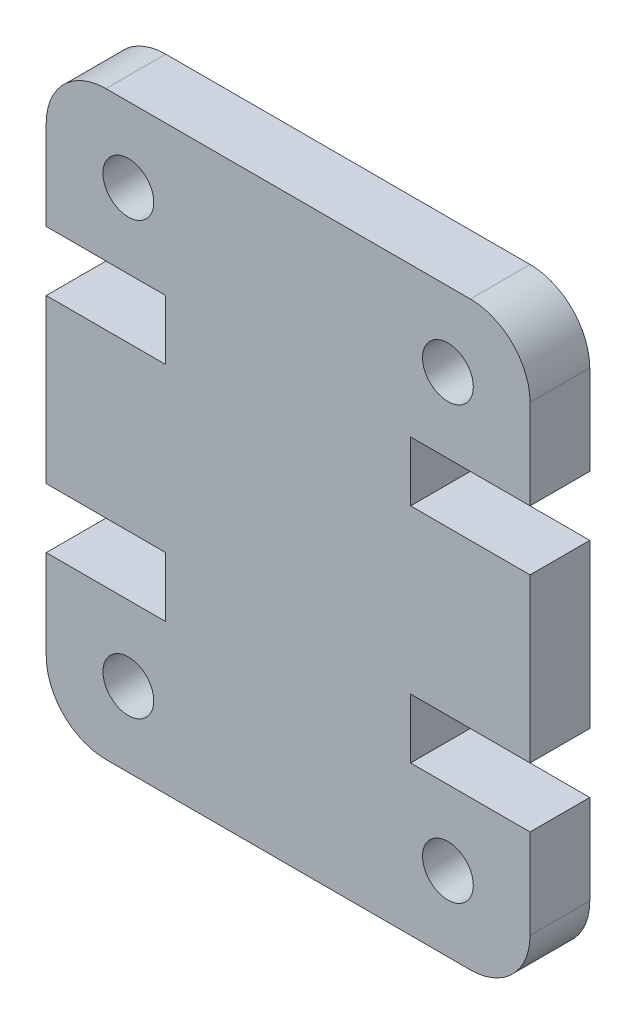
ISO-10303-21;
HEADER;
FILE_DESCRIPTION(('STEP AP214'),'2;1');
FILE_NAME('part.step','',(''),(''),'','','');
FILE_SCHEMA(('AUTOMOTIVE_DESIGN { 1 0 10303 214 1 1 1 1 }'));
ENDSEC;
DATA;
#1=APPLICATION_CONTEXT('core data for automotive mechanical design processes');
#2=APPLICATION_PROTOCOL_DEFINITION('international standard','automotive_design',2000,#1);
#3=PRODUCT_CONTEXT('',#1,'mechanical');
#4=PRODUCT('Part','Part','',(#3));
#5=PRODUCT_RELATED_PRODUCT_CATEGORY('part','',(#4));
#6=PRODUCT_DEFINITION_FORMATION('','',#4);
#7=PRODUCT_DEFINITION_CONTEXT('part definition',#1,'design');
#8=PRODUCT_DEFINITION('design','',#6,#7);
#9=PRODUCT_DEFINITION_SHAPE('','',#8);
#10=(LENGTH_UNIT() NAMED_UNIT(*) SI_UNIT(.MILLI.,.METRE.));
#11=(NAMED_UNIT(*) PLANE_ANGLE_UNIT() SI_UNIT($,.RADIAN.));
#12=(NAMED_UNIT(*) SI_UNIT($,.STERADIAN.) SOLID_ANGLE_UNIT());
#13=UNCERTAINTY_MEASURE_WITH_UNIT(LENGTH_MEASURE(1.E-05),#10,'distance_accuracy_value','');
#14=(GEOMETRIC_REPRESENTATION_CONTEXT(3) GLOBAL_UNCERTAINTY_ASSIGNED_CONTEXT((#13)) GLOBAL_UNIT_ASSIGNED_CONTEXT((#10,
#11,#12)) REPRESENTATION_CONTEXT('',''));
#15=CARTESIAN_POINT('',(0.,0.,0.));
#16=DIRECTION('',(0.,0.,1.));
#17=DIRECTION('',(1.,0.,0.));
#18=AXIS2_PLACEMENT_3D('',#15,#16,#17);
#19=CARTESIAN_POINT('',(14.1999999999999,2.00000000000013,4.));
#20=DIRECTION('',(0.,0.,-1.));
#21=DIRECTION('',(-1.,0.,0.));
#22=AXIS2_PLACEMENT_3D('',#19,#20,#21);
#23=CYLINDRICAL_SURFACE('',#22,2.00000000000013);
#24=CARTESIAN_POINT('',(14.1999999999999,2.00000000000013,2.));
#25=DIRECTION('',(0.,0.,1.));
#26=DIRECTION('',(1.,0.,0.));
#27=AXIS2_PLACEMENT_3D('',#24,#25,#26);
#28=CIRCLE('',#27,2.00000000000013);
#29=CARTESIAN_POINT('',(14.1999999999999,0.,2.));
#30=VERTEX_POINT('',#29);
#31=CARTESIAN_POINT('',(16.2,2.00000000000013,2.));
#32=VERTEX_POINT('',#31);
#33=EDGE_CURVE('E387',#30,#32,#28,.T.);
#34=ORIENTED_EDGE('',*,*,#33,.F.);
#35=DIRECTION('',(0.,0.,-1.));
#36=VECTOR('',#35,1.);
#37=CARTESIAN_POINT('',(14.1999999999999,0.,4.));
#38=LINE('',#37,#36);
#39=CARTESIAN_POINT('',(14.1999999999999,0.,0.));
#40=VERTEX_POINT('',#39);
#41=EDGE_CURVE('E56',#30,#40,#38,.T.);
#42=ORIENTED_EDGE('',*,*,#41,.T.);
#43=CARTESIAN_POINT('',(14.1999999999999,2.00000000000013,0.));
#44=DIRECTION('',(0.,0.,1.));
#45=DIRECTION('',(-1.,0.,0.));
#46=AXIS2_PLACEMENT_3D('',#43,#44,#45);
#47=CIRCLE('',#46,2.00000000000013);
#48=CARTESIAN_POINT('',(16.2,2.00000000000013,0.));
#49=VERTEX_POINT('',#48);
#50=EDGE_CURVE('E265',#40,#49,#47,.T.);
#51=ORIENTED_EDGE('',*,*,#50,.T.);
#52=DIRECTION('',(0.,0.,-1.));
#53=VECTOR('',#52,1.);
#54=CARTESIAN_POINT('',(16.2,2.00000000000013,4.));
#55=LINE('',#54,#53);
#56=EDGE_CURVE('E11',#32,#49,#55,.T.);
#57=ORIENTED_EDGE('',*,*,#56,.F.);
#58=EDGE_LOOP('',(#34,#42,#51,#57));
#59=FACE_BOUND('',#58,.T.);
#60=ADVANCED_FACE('F33',(#59),#23,.T.);
#61=CARTESIAN_POINT('',(16.2,5.00000000000021,4.));
#62=DIRECTION('',(-1.,0.,0.));
#63=DIRECTION('',(0.,0.,1.));
#64=AXIS2_PLACEMENT_3D('',#61,#62,#63);
#65=PLANE('',#64);
#66=DIRECTION('',(0.,1.,0.));
#67=VECTOR('',#66,1.);
#68=CARTESIAN_POINT('',(16.2,0.,2.));
#69=LINE('',#68,#67);
#70=CARTESIAN_POINT('',(16.2,5.00000000000021,2.));
#71=VERTEX_POINT('',#70);
#72=EDGE_CURVE('E435',#32,#71,#69,.T.);
#73=ORIENTED_EDGE('',*,*,#72,.F.);
#74=ORIENTED_EDGE('',*,*,#56,.T.);
#75=DIRECTION('',(0.,1.,0.));
#76=VECTOR('',#75,1.);
#77=CARTESIAN_POINT('',(16.2,5.00000000000021,0.));
#78=LINE('',#77,#76);
#79=CARTESIAN_POINT('',(16.2,5.00000000000021,0.));
#80=VERTEX_POINT('',#79);
#81=EDGE_CURVE('E260',#49,#80,#78,.T.);
#82=ORIENTED_EDGE('',*,*,#81,.T.);
#83=DIRECTION('',(0.,0.,-1.));
#84=VECTOR('',#83,1.);
#85=CARTESIAN_POINT('',(16.2,5.00000000000021,4.));
#86=LINE('',#85,#84);
#87=EDGE_CURVE('E41',#71,#80,#86,.T.);
#88=ORIENTED_EDGE('',*,*,#87,.F.);
#89=EDGE_LOOP('',(#73,#74,#82,#88));
#90=FACE_BOUND('',#89,.T.);
#91=ADVANCED_FACE('F261',(#90),#65,.F.);
#92=CARTESIAN_POINT('',(12.1999999999997,5.00000000000021,4.));
#93=DIRECTION('',(0.,-1.,0.));
#94=DIRECTION('',(0.,0.,-1.));
#95=AXIS2_PLACEMENT_3D('',#92,#93,#94);
#96=PLANE('',#95);
#97=DIRECTION('',(-1.,0.,0.));
#98=VECTOR('',#97,1.);
#99=CARTESIAN_POINT('',(12.1999999999997,5.00000000000021,2.));
#100=LINE('',#99,#98);
#101=CARTESIAN_POINT('',(12.1999999999997,5.00000000000021,2.));
#102=VERTEX_POINT('',#101);
#103=EDGE_CURVE('E256',#71,#102,#100,.T.);
#104=ORIENTED_EDGE('',*,*,#103,.F.);
#105=ORIENTED_EDGE('',*,*,#87,.T.);
#106=DIRECTION('',(-1.,0.,0.));
#107=VECTOR('',#106,1.);
#108=CARTESIAN_POINT('',(12.1999999999997,5.00000000000021,0.));
#109=LINE('',#108,#107);
#110=CARTESIAN_POINT('',(12.1999999999997,5.00000000000021,0.));
#111=VERTEX_POINT('',#110);
#112=EDGE_CURVE('E254',#80,#111,#109,.T.);
#113=ORIENTED_EDGE('',*,*,#112,.T.);
#114=DIRECTION('',(0.,0.,-1.));
#115=VECTOR('',#114,1.);
#116=CARTESIAN_POINT('',(12.1999999999997,5.00000000000021,4.));
#117=LINE('',#116,#115);
#118=EDGE_CURVE('E244',#102,#111,#117,.T.);
#119=ORIENTED_EDGE('',*,*,#118,.F.);
#120=EDGE_LOOP('',(#104,#105,#113,#119));
#121=FACE_BOUND('',#120,.T.);
#122=ADVANCED_FACE('F251',(#121),#96,.F.);
#123=CARTESIAN_POINT('',(12.1999999999997,7.00000000000034,4.));
#124=DIRECTION('',(-1.,0.,0.));
#125=DIRECTION('',(0.,0.,1.));
#126=AXIS2_PLACEMENT_3D('',#123,#124,#125);
#127=PLANE('',#126);
#128=DIRECTION('',(0.,1.,0.));
#129=VECTOR('',#128,1.);
#130=CARTESIAN_POINT('',(12.1999999999997,7.00000000000034,2.));
#131=LINE('',#130,#129);
#132=CARTESIAN_POINT('',(12.1999999999997,7.00000000000034,2.));
#133=VERTEX_POINT('',#132);
#134=EDGE_CURVE('E384',#102,#133,#131,.T.);
#135=ORIENTED_EDGE('',*,*,#134,.F.);
#136=ORIENTED_EDGE('',*,*,#118,.T.);
#137=DIRECTION('',(0.,1.,0.));
#138=VECTOR('',#137,1.);
#139=CARTESIAN_POINT('',(12.1999999999997,7.00000000000034,0.));
#140=LINE('',#139,#138);
#141=CARTESIAN_POINT('',(12.1999999999997,7.00000000000034,0.));
#142=VERTEX_POINT('',#141);
#143=EDGE_CURVE('E271',#111,#142,#140,.T.);
#144=ORIENTED_EDGE('',*,*,#143,.T.);
#145=DIRECTION('',(0.,0.,-1.));
#146=VECTOR('',#145,1.);
#147=CARTESIAN_POINT('',(12.1999999999997,7.00000000000034,4.));
#148=LINE('',#147,#146);
#149=EDGE_CURVE('E242',#133,#142,#148,.T.);
#150=ORIENTED_EDGE('',*,*,#149,.F.);
#151=EDGE_LOOP('',(#135,#136,#144,#150));
#152=FACE_BOUND('',#151,.T.);
#153=ADVANCED_FACE('F483',(#152),#127,.F.);
#154=CARTESIAN_POINT('',(16.2,7.00000000000034,4.));
#155=DIRECTION('',(0.,1.,0.));
#156=DIRECTION('',(-1.,0.,0.));
#157=AXIS2_PLACEMENT_3D('',#154,#155,#156);
#158=PLANE('',#157);
#159=DIRECTION('',(1.,0.,0.));
#160=VECTOR('',#159,1.);
#161=CARTESIAN_POINT('',(16.2,7.00000000000034,2.));
#162=LINE('',#161,#160);
#163=CARTESIAN_POINT('',(16.2,7.00000000000034,2.));
#164=VERTEX_POINT('',#163);
#165=EDGE_CURVE('E382',#133,#164,#162,.T.);
#166=ORIENTED_EDGE('',*,*,#165,.F.);
#167=ORIENTED_EDGE('',*,*,#149,.T.);
#168=DIRECTION('',(1.,0.,0.));
#169=VECTOR('',#168,1.);
#170=CARTESIAN_POINT('',(16.2,7.00000000000034,0.));
#171=LINE('',#170,#169);
#172=CARTESIAN_POINT('',(16.2,7.00000000000034,0.));
#173=VERTEX_POINT('',#172);
#174=EDGE_CURVE('E273',#142,#173,#171,.T.);
#175=ORIENTED_EDGE('',*,*,#174,.T.);
#176=DIRECTION('',(0.,0.,-1.));
#177=VECTOR('',#176,1.);
#178=CARTESIAN_POINT('',(16.2,7.00000000000034,4.));
#179=LINE('',#178,#177);
#180=EDGE_CURVE('E240',#164,#173,#179,.T.);
#181=ORIENTED_EDGE('',*,*,#180,.F.);
#182=EDGE_LOOP('',(#166,#167,#175,#181));
#183=FACE_BOUND('',#182,.T.);
#184=ADVANCED_FACE('F488',(#183),#158,.F.);
#185=CARTESIAN_POINT('',(16.2,7.00000000000034,4.));
#186=DIRECTION('',(-1.,0.,0.));
#187=DIRECTION('',(0.,0.,1.));
#188=AXIS2_PLACEMENT_3D('',#185,#186,#187);
#189=PLANE('',#188);
#190=CARTESIAN_POINT('',(16.2,12.4549999999997,2.));
#191=VERTEX_POINT('',#190);
#192=EDGE_CURVE('E434',#164,#191,#69,.T.);
#193=ORIENTED_EDGE('',*,*,#192,.F.);
#194=ORIENTED_EDGE('',*,*,#180,.T.);
#195=DIRECTION('',(0.,1.,0.));
#196=VECTOR('',#195,1.);
#197=CARTESIAN_POINT('',(16.2,7.00000000000034,0.));
#198=LINE('',#197,#196);
#199=CARTESIAN_POINT('',(16.2,12.4549999999997,0.));
#200=VERTEX_POINT('',#199);
#201=EDGE_CURVE('E279',#173,#200,#198,.T.);
#202=ORIENTED_EDGE('',*,*,#201,.T.);
#203=DIRECTION('',(0.,0.,-1.));
#204=VECTOR('',#203,1.);
#205=CARTESIAN_POINT('',(16.2,12.4549999999997,4.));
#206=LINE('',#205,#204);
#207=EDGE_CURVE('E238',#191,#200,#206,.T.);
#208=ORIENTED_EDGE('',*,*,#207,.F.);
#209=EDGE_LOOP('',(#193,#194,#202,#208));
#210=FACE_BOUND('',#209,.T.);
#211=ADVANCED_FACE('F492',(#210),#189,.F.);
#212=CARTESIAN_POINT('',(16.2,12.4549999999997,4.));
#213=DIRECTION('',(0.,-1.,0.));
#214=DIRECTION('',(1.,0.,0.));
#215=AXIS2_PLACEMENT_3D('',#212,#213,#214);
#216=PLANE('',#215);
#217=DIRECTION('',(-1.,0.,0.));
#218=VECTOR('',#217,1.);
#219=CARTESIAN_POINT('',(16.2,12.4549999999997,2.));
#220=LINE('',#219,#218);
#221=CARTESIAN_POINT('',(12.1999999999997,12.4549999999997,2.));
#222=VERTEX_POINT('',#221);
#223=EDGE_CURVE('E380',#191,#222,#220,.T.);
#224=ORIENTED_EDGE('',*,*,#223,.F.);
#225=ORIENTED_EDGE('',*,*,#207,.T.);
#226=DIRECTION('',(-1.,0.,0.));
#227=VECTOR('',#226,1.);
#228=CARTESIAN_POINT('',(16.2,12.4549999999997,0.));
#229=LINE('',#228,#227);
#230=CARTESIAN_POINT('',(12.1999999999997,12.4549999999997,0.));
#231=VERTEX_POINT('',#230);
#232=EDGE_CURVE('E282',#200,#231,#229,.T.);
#233=ORIENTED_EDGE('',*,*,#232,.T.);
#234=DIRECTION('',(0.,0.,-1.));
#235=VECTOR('',#234,1.);
#236=CARTESIAN_POINT('',(12.1999999999997,12.4549999999997,4.));
#237=LINE('',#236,#235);
#238=EDGE_CURVE('E236',#222,#231,#237,.T.);
#239=ORIENTED_EDGE('',*,*,#238,.F.);
#240=EDGE_LOOP('',(#224,#225,#233,#239));
#241=FACE_BOUND('',#240,.T.);
#242=ADVANCED_FACE('F496',(#241),#216,.F.);
#243=CARTESIAN_POINT('',(12.1999999999997,12.4549999999997,4.));
#244=DIRECTION('',(-1.,0.,0.));
#245=DIRECTION('',(0.,0.,1.));
#246=AXIS2_PLACEMENT_3D('',#243,#244,#245);
#247=PLANE('',#246);
#248=DIRECTION('',(0.,1.,0.));
#249=VECTOR('',#248,1.);
#250=CARTESIAN_POINT('',(12.1999999999997,12.4549999999997,2.));
#251=LINE('',#250,#249);
#252=CARTESIAN_POINT('',(12.1999999999997,14.4549999999998,2.));
#253=VERTEX_POINT('',#252);
#254=EDGE_CURVE('E378',#222,#253,#251,.T.);
#255=ORIENTED_EDGE('',*,*,#254,.F.);
#256=ORIENTED_EDGE('',*,*,#238,.T.);
#257=DIRECTION('',(0.,1.,0.));
#258=VECTOR('',#257,1.);
#259=CARTESIAN_POINT('',(12.1999999999997,12.4549999999997,0.));
#260=LINE('',#259,#258);
#261=CARTESIAN_POINT('',(12.1999999999997,14.4549999999998,0.));
#262=VERTEX_POINT('',#261);
#263=EDGE_CURVE('E285',#231,#262,#260,.T.);
#264=ORIENTED_EDGE('',*,*,#263,.T.);
#265=DIRECTION('',(0.,0.,-1.));
#266=VECTOR('',#265,1.);
#267=CARTESIAN_POINT('',(12.1999999999997,14.4549999999998,4.));
#268=LINE('',#267,#266);
#269=EDGE_CURVE('E234',#253,#262,#268,.T.);
#270=ORIENTED_EDGE('',*,*,#269,.F.);
#271=EDGE_LOOP('',(#255,#256,#264,#270));
#272=FACE_BOUND('',#271,.T.);
#273=ADVANCED_FACE('F500',(#272),#247,.F.);
#274=CARTESIAN_POINT('',(12.1999999999997,14.4549999999998,4.));
#275=DIRECTION('',(0.,1.,0.));
#276=DIRECTION('',(0.,0.,1.));
#277=AXIS2_PLACEMENT_3D('',#274,#275,#276);
#278=PLANE('',#277);
#279=DIRECTION('',(1.,0.,0.));
#280=VECTOR('',#279,1.);
#281=CARTESIAN_POINT('',(12.1999999999997,14.4549999999998,2.));
#282=LINE('',#281,#280);
#283=CARTESIAN_POINT('',(16.2,14.4549999999998,2.));
#284=VERTEX_POINT('',#283);
#285=EDGE_CURVE('E376',#253,#284,#282,.T.);
#286=ORIENTED_EDGE('',*,*,#285,.F.);
#287=ORIENTED_EDGE('',*,*,#269,.T.);
#288=DIRECTION('',(1.,0.,0.));
#289=VECTOR('',#288,1.);
#290=CARTESIAN_POINT('',(12.1999999999997,14.4549999999998,0.));
#291=LINE('',#290,#289);
#292=CARTESIAN_POINT('',(16.2,14.4549999999998,0.));
#293=VERTEX_POINT('',#292);
#294=EDGE_CURVE('E288',#262,#293,#291,.T.);
#295=ORIENTED_EDGE('',*,*,#294,.T.);
#296=DIRECTION('',(0.,0.,-1.));
#297=VECTOR('',#296,1.);
#298=CARTESIAN_POINT('',(16.2,14.4549999999998,4.));
#299=LINE('',#298,#297);
#300=EDGE_CURVE('E232',#284,#293,#299,.T.);
#301=ORIENTED_EDGE('',*,*,#300,.F.);
#302=EDGE_LOOP('',(#286,#287,#295,#301));
#303=FACE_BOUND('',#302,.T.);
#304=ADVANCED_FACE('F504',(#303),#278,.F.);
#305=CARTESIAN_POINT('',(16.2,14.4549999999998,4.));
#306=DIRECTION('',(-1.,0.,0.));
#307=DIRECTION('',(0.,0.,1.));
#308=AXIS2_PLACEMENT_3D('',#305,#306,#307);
#309=PLANE('',#308);
#310=CARTESIAN_POINT('',(16.2,17.4549999999999,2.));
#311=VERTEX_POINT('',#310);
#312=EDGE_CURVE('E432',#284,#311,#69,.T.);
#313=ORIENTED_EDGE('',*,*,#312,.F.);
#314=ORIENTED_EDGE('',*,*,#300,.T.);
#315=DIRECTION('',(0.,1.,0.));
#316=VECTOR('',#315,1.);
#317=CARTESIAN_POINT('',(16.2,14.4549999999998,0.));
#318=LINE('',#317,#316);
#319=CARTESIAN_POINT('',(16.2,17.4549999999999,0.));
#320=VERTEX_POINT('',#319);
#321=EDGE_CURVE('E291',#293,#320,#318,.T.);
#322=ORIENTED_EDGE('',*,*,#321,.T.);
#323=DIRECTION('',(0.,0.,-1.));
#324=VECTOR('',#323,1.);
#325=CARTESIAN_POINT('',(16.2,17.4549999999999,4.));
#326=LINE('',#325,#324);
#327=EDGE_CURVE('E230',#311,#320,#326,.T.);
#328=ORIENTED_EDGE('',*,*,#327,.F.);
#329=EDGE_LOOP('',(#313,#314,#322,#328));
#330=FACE_BOUND('',#329,.T.);
#331=ADVANCED_FACE('F508',(#330),#309,.F.);
#332=CARTESIAN_POINT('',(14.1999999999999,17.4549999999999,4.));
#333=DIRECTION('',(0.,0.,-1.));
#334=DIRECTION('',(-1.,0.,0.));
#335=AXIS2_PLACEMENT_3D('',#332,#333,#334);
#336=CYLINDRICAL_SURFACE('',#335,2.00000000000013);
#337=CARTESIAN_POINT('',(14.1999999999999,17.4549999999999,2.));
#338=DIRECTION('',(0.,0.,1.));
#339=DIRECTION('',(1.,0.,0.));
#340=AXIS2_PLACEMENT_3D('',#337,#338,#339);
#341=CIRCLE('',#340,2.00000000000013);
#342=CARTESIAN_POINT('',(14.1999999999999,19.455,2.));
#343=VERTEX_POINT('',#342);
#344=EDGE_CURVE('E203',#311,#343,#341,.T.);
#345=ORIENTED_EDGE('',*,*,#344,.F.);
#346=ORIENTED_EDGE('',*,*,#327,.T.);
#347=CARTESIAN_POINT('',(14.1999999999999,17.4549999999999,0.));
#348=DIRECTION('',(0.,0.,1.));
#349=DIRECTION('',(1.,0.,0.));
#350=AXIS2_PLACEMENT_3D('',#347,#348,#349);
#351=CIRCLE('',#350,2.00000000000013);
#352=CARTESIAN_POINT('',(14.1999999999999,19.455,0.));
#353=VERTEX_POINT('',#352);
#354=EDGE_CURVE('E294',#320,#353,#351,.T.);
#355=ORIENTED_EDGE('',*,*,#354,.T.);
#356=DIRECTION('',(0.,0.,-1.));
#357=VECTOR('',#356,1.);
#358=CARTESIAN_POINT('',(14.1999999999999,19.455,4.));
#359=LINE('',#358,#357);
#360=EDGE_CURVE('E223',#343,#353,#359,.T.);
#361=ORIENTED_EDGE('',*,*,#360,.F.);
#362=EDGE_LOOP('',(#345,#346,#355,#361));
#363=FACE_BOUND('',#362,.T.);
#364=ADVANCED_FACE('F512',(#363),#336,.T.);
#365=CARTESIAN_POINT('',(2.00000000000012,19.455,4.));
#366=DIRECTION('',(0.,-1.,0.));
#367=DIRECTION('',(0.,0.,-1.));
#368=AXIS2_PLACEMENT_3D('',#365,#366,#367);
#369=PLANE('',#368);
#370=DIRECTION('',(-1.,0.,0.));
#371=VECTOR('',#370,1.);
#372=CARTESIAN_POINT('',(16.2,19.455,2.));
#373=LINE('',#372,#371);
#374=CARTESIAN_POINT('',(2.00000000000012,19.455,2.));
#375=VERTEX_POINT('',#374);
#376=EDGE_CURVE('E199',#343,#375,#373,.T.);
#377=ORIENTED_EDGE('',*,*,#376,.F.);
#378=ORIENTED_EDGE('',*,*,#360,.T.);
#379=DIRECTION('',(-1.,0.,0.));
#380=VECTOR('',#379,1.);
#381=CARTESIAN_POINT('',(2.00000000000012,19.455,0.));
#382=LINE('',#381,#380);
#383=CARTESIAN_POINT('',(2.00000000000012,19.455,0.));
#384=VERTEX_POINT('',#383);
#385=EDGE_CURVE('E297',#353,#384,#382,.T.);
#386=ORIENTED_EDGE('',*,*,#385,.T.);
#387=DIRECTION('',(0.,0.,-1.));
#388=VECTOR('',#387,1.);
#389=CARTESIAN_POINT('',(2.00000000000012,19.455,4.));
#390=LINE('',#389,#388);
#391=EDGE_CURVE('E221',#375,#384,#390,.T.);
#392=ORIENTED_EDGE('',*,*,#391,.F.);
#393=EDGE_LOOP('',(#377,#378,#386,#392));
#394=FACE_BOUND('',#393,.T.);
#395=ADVANCED_FACE('F516',(#394),#369,.F.);
#396=CARTESIAN_POINT('',(2.00000000000012,17.4549999999999,4.));
#397=DIRECTION('',(0.,0.,-1.));
#398=DIRECTION('',(-1.,0.,0.));
#399=AXIS2_PLACEMENT_3D('',#396,#397,#398);
#400=CYLINDRICAL_SURFACE('',#399,2.00000000000013);
#401=CARTESIAN_POINT('',(2.00000000000012,17.4549999999999,2.));
#402=DIRECTION('',(0.,0.,1.));
#403=DIRECTION('',(1.,0.,0.));
#404=AXIS2_PLACEMENT_3D('',#401,#402,#403);
#405=CIRCLE('',#404,2.00000000000013);
#406=CARTESIAN_POINT('',(0.,17.4549999999999,2.));
#407=VERTEX_POINT('',#406);
#408=EDGE_CURVE('E193',#375,#407,#405,.T.);
#409=ORIENTED_EDGE('',*,*,#408,.F.);
#410=ORIENTED_EDGE('',*,*,#391,.T.);
#411=CARTESIAN_POINT('',(2.00000000000012,17.4549999999999,0.));
#412=DIRECTION('',(0.,0.,1.));
#413=DIRECTION('',(-1.,0.,0.));
#414=AXIS2_PLACEMENT_3D('',#411,#412,#413);
#415=CIRCLE('',#414,2.00000000000013);
#416=CARTESIAN_POINT('',(0.,17.4549999999999,0.));
#417=VERTEX_POINT('',#416);
#418=EDGE_CURVE('E219',#384,#417,#415,.T.);
#419=ORIENTED_EDGE('',*,*,#418,.T.);
#420=DIRECTION('',(0.,0.,-1.));
#421=VECTOR('',#420,1.);
#422=CARTESIAN_POINT('',(0.,17.4549999999999,4.));
#423=LINE('',#422,#421);
#424=EDGE_CURVE('E210',#407,#417,#423,.T.);
#425=ORIENTED_EDGE('',*,*,#424,.F.);
#426=EDGE_LOOP('',(#409,#410,#419,#425));
#427=FACE_BOUND('',#426,.T.);
#428=ADVANCED_FACE('F217',(#427),#400,.T.);
#429=CARTESIAN_POINT('',(0.,14.4549999999998,4.));
#430=DIRECTION('',(1.,0.,0.));
#431=DIRECTION('',(0.,1.,0.));
#432=AXIS2_PLACEMENT_3D('',#429,#430,#431);
#433=PLANE('',#432);
#434=DIRECTION('',(0.,-1.,0.));
#435=VECTOR('',#434,1.);
#436=CARTESIAN_POINT('',(0.,19.455,2.));
#437=LINE('',#436,#435);
#438=CARTESIAN_POINT('',(0.,14.4549999999998,2.));
#439=VERTEX_POINT('',#438);
#440=EDGE_CURVE('E196',#407,#439,#437,.T.);
#441=ORIENTED_EDGE('',*,*,#440,.F.);
#442=ORIENTED_EDGE('',*,*,#424,.T.);
#443=DIRECTION('',(0.,-1.,0.));
#444=VECTOR('',#443,1.);
#445=CARTESIAN_POINT('',(0.,14.4549999999998,0.));
#446=LINE('',#445,#444);
#447=CARTESIAN_POINT('',(0.,14.4549999999998,0.));
#448=VERTEX_POINT('',#447);
#449=EDGE_CURVE('E301',#417,#448,#446,.T.);
#450=ORIENTED_EDGE('',*,*,#449,.T.);
#451=DIRECTION('',(0.,0.,-1.));
#452=VECTOR('',#451,1.);
#453=CARTESIAN_POINT('',(0.,14.4549999999998,4.));
#454=LINE('',#453,#452);
#455=EDGE_CURVE('E212',#439,#448,#454,.T.);
#456=ORIENTED_EDGE('',*,*,#455,.F.);
#457=EDGE_LOOP('',(#441,#442,#450,#456));
#458=FACE_BOUND('',#457,.T.);
#459=ADVANCED_FACE('F208',(#458),#433,.F.);
#460=CARTESIAN_POINT('',(4.00000000000025,14.4549999999998,4.));
#461=DIRECTION('',(0.,1.,0.));
#462=DIRECTION('',(0.,0.,1.));
#463=AXIS2_PLACEMENT_3D('',#460,#461,#462);
#464=PLANE('',#463);
#465=DIRECTION('',(1.,0.,0.));
#466=VECTOR('',#465,1.);
#467=CARTESIAN_POINT('',(4.00000000000025,14.4549999999998,2.));
#468=LINE('',#467,#466);
#469=CARTESIAN_POINT('',(4.00000000000025,14.4549999999998,2.));
#470=VERTEX_POINT('',#469);
#471=EDGE_CURVE('E204',#439,#470,#468,.T.);
#472=ORIENTED_EDGE('',*,*,#471,.F.);
#473=ORIENTED_EDGE('',*,*,#455,.T.);
#474=DIRECTION('',(1.,0.,0.));
#475=VECTOR('',#474,1.);
#476=CARTESIAN_POINT('',(4.00000000000025,14.4549999999998,0.));
#477=LINE('',#476,#475);
#478=CARTESIAN_POINT('',(4.00000000000025,14.4549999999998,0.));
#479=VERTEX_POINT('',#478);
#480=EDGE_CURVE('E303',#448,#479,#477,.T.);
#481=ORIENTED_EDGE('',*,*,#480,.T.);
#482=DIRECTION('',(0.,0.,-1.));
#483=VECTOR('',#482,1.);
#484=CARTESIAN_POINT('',(4.00000000000025,14.4549999999998,4.));
#485=LINE('',#484,#483);
#486=EDGE_CURVE('E225',#470,#479,#485,.T.);
#487=ORIENTED_EDGE('',*,*,#486,.F.);
#488=EDGE_LOOP('',(#472,#473,#481,#487));
#489=FACE_BOUND('',#488,.T.);
#490=ADVANCED_FACE('F358',(#489),#464,.F.);
#491=CARTESIAN_POINT('',(4.00000000000025,12.4549999999997,4.));
#492=DIRECTION('',(1.,0.,0.));
#493=DIRECTION('',(0.,0.,-1.));
#494=AXIS2_PLACEMENT_3D('',#491,#492,#493);
#495=PLANE('',#494);
#496=DIRECTION('',(0.,-1.,0.));
#497=VECTOR('',#496,1.);
#498=CARTESIAN_POINT('',(4.00000000000025,12.4549999999997,2.));
#499=LINE('',#498,#497);
#500=CARTESIAN_POINT('',(4.00000000000025,12.4549999999997,2.));
#501=VERTEX_POINT('',#500);
#502=EDGE_CURVE('E355',#470,#501,#499,.T.);
#503=ORIENTED_EDGE('',*,*,#502,.F.);
#504=ORIENTED_EDGE('',*,*,#486,.T.);
#505=DIRECTION('',(0.,-1.,0.));
#506=VECTOR('',#505,1.);
#507=CARTESIAN_POINT('',(4.00000000000025,12.4549999999997,0.));
#508=LINE('',#507,#506);
#509=CARTESIAN_POINT('',(4.00000000000025,12.4549999999997,0.));
#510=VERTEX_POINT('',#509);
#511=EDGE_CURVE('E306',#479,#510,#508,.T.);
#512=ORIENTED_EDGE('',*,*,#511,.T.);
#513=DIRECTION('',(0.,0.,-1.));
#514=VECTOR('',#513,1.);
#515=CARTESIAN_POINT('',(4.00000000000025,12.4549999999997,4.));
#516=LINE('',#515,#514);
#517=EDGE_CURVE('E347',#501,#510,#516,.T.);
#518=ORIENTED_EDGE('',*,*,#517,.F.);
#519=EDGE_LOOP('',(#503,#504,#512,#518));
#520=FACE_BOUND('',#519,.T.);
#521=ADVANCED_FACE('F351',(#520),#495,.F.);
#522=CARTESIAN_POINT('',(0.,12.4549999999997,4.));
#523=DIRECTION('',(0.,-1.,0.));
#524=DIRECTION('',(1.,0.,0.));
#525=AXIS2_PLACEMENT_3D('',#522,#523,#524);
#526=PLANE('',#525);
#527=DIRECTION('',(-1.,0.,0.));
#528=VECTOR('',#527,1.);
#529=CARTESIAN_POINT('',(0.,12.4549999999997,2.));
#530=LINE('',#529,#528);
#531=CARTESIAN_POINT('',(0.,12.4549999999997,2.));
#532=VERTEX_POINT('',#531);
#533=EDGE_CURVE('E365',#501,#532,#530,.T.);
#534=ORIENTED_EDGE('',*,*,#533,.F.);
#535=ORIENTED_EDGE('',*,*,#517,.T.);
#536=DIRECTION('',(-1.,0.,0.));
#537=VECTOR('',#536,1.);
#538=CARTESIAN_POINT('',(0.,12.4549999999997,0.));
#539=LINE('',#538,#537);
#540=CARTESIAN_POINT('',(0.,12.4549999999997,0.));
#541=VERTEX_POINT('',#540);
#542=EDGE_CURVE('E309',#510,#541,#539,.T.);
#543=ORIENTED_EDGE('',*,*,#542,.T.);
#544=DIRECTION('',(0.,0.,-1.));
#545=VECTOR('',#544,1.);
#546=CARTESIAN_POINT('',(0.,12.4549999999997,4.));
#547=LINE('',#546,#545);
#548=EDGE_CURVE('E345',#532,#541,#547,.T.);
#549=ORIENTED_EDGE('',*,*,#548,.F.);
#550=EDGE_LOOP('',(#534,#535,#543,#549));
#551=FACE_BOUND('',#550,.T.);
#552=ADVANCED_FACE('F364',(#551),#526,.F.);
#553=CARTESIAN_POINT('',(0.,7.00000000000034,4.));
#554=DIRECTION('',(1.,0.,0.));
#555=DIRECTION('',(0.,1.,0.));
#556=AXIS2_PLACEMENT_3D('',#553,#554,#555);
#557=PLANE('',#556);
#558=CARTESIAN_POINT('',(0.,7.00000000000032,2.));
#559=VERTEX_POINT('',#558);
#560=EDGE_CURVE('E214',#532,#559,#437,.T.);
#561=ORIENTED_EDGE('',*,*,#560,.F.);
#562=ORIENTED_EDGE('',*,*,#548,.T.);
#563=DIRECTION('',(0.,-1.,0.));
#564=VECTOR('',#563,1.);
#565=CARTESIAN_POINT('',(0.,7.00000000000034,0.));
#566=LINE('',#565,#564);
#567=CARTESIAN_POINT('',(0.,7.00000000000034,0.));
#568=VERTEX_POINT('',#567);
#569=EDGE_CURVE('E312',#541,#568,#566,.T.);
#570=ORIENTED_EDGE('',*,*,#569,.T.);
#571=DIRECTION('',(0.,0.,-1.));
#572=VECTOR('',#571,1.);
#573=CARTESIAN_POINT('',(0.,7.00000000000034,4.));
#574=LINE('',#573,#572);
#575=EDGE_CURVE('E343',#559,#568,#574,.T.);
#576=ORIENTED_EDGE('',*,*,#575,.F.);
#577=EDGE_LOOP('',(#561,#562,#570,#576));
#578=FACE_BOUND('',#577,.T.);
#579=ADVANCED_FACE('F429',(#578),#557,.F.);
#580=CARTESIAN_POINT('',(0.,7.00000000000034,4.));
#581=DIRECTION('',(0.,1.,0.));
#582=DIRECTION('',(-1.,0.,0.));
#583=AXIS2_PLACEMENT_3D('',#580,#581,#582);
#584=PLANE('',#583);
#585=DIRECTION('',(1.,0.,0.));
#586=VECTOR('',#585,1.);
#587=CARTESIAN_POINT('',(0.,7.00000000000034,2.));
#588=LINE('',#587,#586);
#589=CARTESIAN_POINT('',(4.00000000000016,7.00000000000031,2.));
#590=VERTEX_POINT('',#589);
#591=EDGE_CURVE('E367',#559,#590,#588,.T.);
#592=ORIENTED_EDGE('',*,*,#591,.F.);
#593=ORIENTED_EDGE('',*,*,#575,.T.);
#594=DIRECTION('',(1.,0.,0.));
#595=VECTOR('',#594,1.);
#596=CARTESIAN_POINT('',(0.,7.00000000000034,0.));
#597=LINE('',#596,#595);
#598=CARTESIAN_POINT('',(4.00000000000016,7.00000000000031,0.));
#599=VERTEX_POINT('',#598);
#600=EDGE_CURVE('E315',#568,#599,#597,.T.);
#601=ORIENTED_EDGE('',*,*,#600,.T.);
#602=DIRECTION('',(0.,0.,-1.));
#603=VECTOR('',#602,1.);
#604=CARTESIAN_POINT('',(4.00000000000016,7.00000000000031,4.));
#605=LINE('',#604,#603);
#606=EDGE_CURVE('E341',#590,#599,#605,.T.);
#607=ORIENTED_EDGE('',*,*,#606,.F.);
#608=EDGE_LOOP('',(#592,#593,#601,#607));
#609=FACE_BOUND('',#608,.T.);
#610=ADVANCED_FACE('F426',(#609),#584,.F.);
#611=CARTESIAN_POINT('',(4.00000000000016,7.00000000000031,4.));
#612=DIRECTION('',(1.,0.,0.));
#613=DIRECTION('',(0.,0.,-1.));
#614=AXIS2_PLACEMENT_3D('',#611,#612,#613);
#615=PLANE('',#614);
#616=DIRECTION('',(0.,-1.,0.));
#617=VECTOR('',#616,1.);
#618=CARTESIAN_POINT('',(4.00000000000016,7.00000000000031,2.));
#619=LINE('',#618,#617);
#620=CARTESIAN_POINT('',(4.00000000000016,5.00000000000021,2.));
#621=VERTEX_POINT('',#620);
#622=EDGE_CURVE('E370',#590,#621,#619,.T.);
#623=ORIENTED_EDGE('',*,*,#622,.F.);
#624=ORIENTED_EDGE('',*,*,#606,.T.);
#625=DIRECTION('',(0.,-1.,0.));
#626=VECTOR('',#625,1.);
#627=CARTESIAN_POINT('',(4.00000000000016,7.00000000000031,0.));
#628=LINE('',#627,#626);
#629=CARTESIAN_POINT('',(4.00000000000016,5.00000000000021,0.));
#630=VERTEX_POINT('',#629);
#631=EDGE_CURVE('E318',#599,#630,#628,.T.);
#632=ORIENTED_EDGE('',*,*,#631,.T.);
#633=DIRECTION('',(0.,0.,-1.));
#634=VECTOR('',#633,1.);
#635=CARTESIAN_POINT('',(4.00000000000016,5.00000000000021,4.));
#636=LINE('',#635,#634);
#637=EDGE_CURVE('E339',#621,#630,#636,.T.);
#638=ORIENTED_EDGE('',*,*,#637,.F.);
#639=EDGE_LOOP('',(#623,#624,#632,#638));
#640=FACE_BOUND('',#639,.T.);
#641=ADVANCED_FACE('F422',(#640),#615,.F.);
#642=CARTESIAN_POINT('',(4.00000000000016,5.00000000000021,4.));
#643=DIRECTION('',(0.,-1.,0.));
#644=DIRECTION('',(1.,0.,0.));
#645=AXIS2_PLACEMENT_3D('',#642,#643,#644);
#646=PLANE('',#645);
#647=DIRECTION('',(-1.,0.,0.));
#648=VECTOR('',#647,1.);
#649=CARTESIAN_POINT('',(4.00000000000016,5.00000000000021,2.));
#650=LINE('',#649,#648);
#651=CARTESIAN_POINT('',(0.,5.00000000000021,2.));
#652=VERTEX_POINT('',#651);
#653=EDGE_CURVE('E419',#621,#652,#650,.T.);
#654=ORIENTED_EDGE('',*,*,#653,.F.);
#655=ORIENTED_EDGE('',*,*,#637,.T.);
#656=DIRECTION('',(-1.,0.,0.));
#657=VECTOR('',#656,1.);
#658=CARTESIAN_POINT('',(4.00000000000016,5.00000000000021,0.));
#659=LINE('',#658,#657);
#660=CARTESIAN_POINT('',(0.,5.00000000000021,0.));
#661=VERTEX_POINT('',#660);
#662=EDGE_CURVE('E321',#630,#661,#659,.T.);
#663=ORIENTED_EDGE('',*,*,#662,.T.);
#664=DIRECTION('',(0.,0.,-1.));
#665=VECTOR('',#664,1.);
#666=CARTESIAN_POINT('',(0.,5.00000000000021,4.));
#667=LINE('',#666,#665);
#668=EDGE_CURVE('E337',#652,#661,#667,.T.);
#669=ORIENTED_EDGE('',*,*,#668,.F.);
#670=EDGE_LOOP('',(#654,#655,#663,#669));
#671=FACE_BOUND('',#670,.T.);
#672=ADVANCED_FACE('F417',(#671),#646,.F.);
#673=CARTESIAN_POINT('',(0.,5.00000000000021,4.));
#674=DIRECTION('',(1.,0.,0.));
#675=DIRECTION('',(0.,1.,0.));
#676=AXIS2_PLACEMENT_3D('',#673,#674,#675);
#677=PLANE('',#676);
#678=CARTESIAN_POINT('',(0.,2.00000000000013,2.));
#679=VERTEX_POINT('',#678);
#680=EDGE_CURVE('E216',#652,#679,#437,.T.);
#681=ORIENTED_EDGE('',*,*,#680,.F.);
#682=ORIENTED_EDGE('',*,*,#668,.T.);
#683=DIRECTION('',(0.,-1.,0.));
#684=VECTOR('',#683,1.);
#685=CARTESIAN_POINT('',(0.,5.00000000000021,0.));
#686=LINE('',#685,#684);
#687=CARTESIAN_POINT('',(0.,2.0000000000001,0.));
#688=VERTEX_POINT('',#687);
#689=EDGE_CURVE('E324',#661,#688,#686,.T.);
#690=ORIENTED_EDGE('',*,*,#689,.T.);
#691=DIRECTION('',(0.,0.,-1.));
#692=VECTOR('',#691,1.);
#693=CARTESIAN_POINT('',(0.,2.0000000000001,4.));
#694=LINE('',#693,#692);
#695=EDGE_CURVE('E335',#679,#688,#694,.T.);
#696=ORIENTED_EDGE('',*,*,#695,.F.);
#697=EDGE_LOOP('',(#681,#682,#690,#696));
#698=FACE_BOUND('',#697,.T.);
#699=ADVANCED_FACE('F411',(#698),#677,.F.);
#700=CARTESIAN_POINT('',(2.00000000000007,2.00000000000013,4.));
#701=DIRECTION('',(0.,0.,-1.));
#702=DIRECTION('',(-1.,0.,0.));
#703=AXIS2_PLACEMENT_3D('',#700,#701,#702);
#704=CYLINDRICAL_SURFACE('',#703,2.0000000000001);
#705=CARTESIAN_POINT('',(2.00000000000007,2.00000000000013,2.));
#706=DIRECTION('',(0.,0.,1.));
#707=DIRECTION('',(1.,0.,0.));
#708=AXIS2_PLACEMENT_3D('',#705,#706,#707);
#709=CIRCLE('',#708,2.0000000000001);
#710=CARTESIAN_POINT('',(2.00000000000008,0.,2.));
#711=VERTEX_POINT('',#710);
#712=EDGE_CURVE('E48',#679,#711,#709,.T.);
#713=ORIENTED_EDGE('',*,*,#712,.F.);
#714=ORIENTED_EDGE('',*,*,#695,.T.);
#715=CARTESIAN_POINT('',(2.00000000000007,2.00000000000013,0.));
#716=DIRECTION('',(0.,0.,1.));
#717=DIRECTION('',(1.,0.,0.));
#718=AXIS2_PLACEMENT_3D('',#715,#716,#717);
#719=CIRCLE('',#718,2.0000000000001);
#720=CARTESIAN_POINT('',(2.00000000000008,0.,0.));
#721=VERTEX_POINT('',#720);
#722=EDGE_CURVE('E327',#688,#721,#719,.T.);
#723=ORIENTED_EDGE('',*,*,#722,.T.);
#724=DIRECTION('',(0.,0.,-1.));
#725=VECTOR('',#724,1.);
#726=CARTESIAN_POINT('',(2.00000000000008,0.,4.));
#727=LINE('',#726,#725);
#728=EDGE_CURVE('E333',#711,#721,#727,.T.);
#729=ORIENTED_EDGE('',*,*,#728,.F.);
#730=EDGE_LOOP('',(#713,#714,#723,#729));
#731=FACE_BOUND('',#730,.T.);
#732=ADVANCED_FACE('F407',(#731),#704,.T.);
#733=CARTESIAN_POINT('',(2.00000000000008,0.,4.));
#734=DIRECTION('',(0.,1.,0.));
#735=DIRECTION('',(-1.,0.,0.));
#736=AXIS2_PLACEMENT_3D('',#733,#734,#735);
#737=PLANE('',#736);
#738=DIRECTION('',(1.,0.,0.));
#739=VECTOR('',#738,1.);
#740=CARTESIAN_POINT('',(0.,0.,2.));
#741=LINE('',#740,#739);
#742=EDGE_CURVE('E213',#711,#30,#741,.T.);
#743=ORIENTED_EDGE('',*,*,#742,.F.);
#744=ORIENTED_EDGE('',*,*,#728,.T.);
#745=DIRECTION('',(1.,0.,0.));
#746=VECTOR('',#745,1.);
#747=CARTESIAN_POINT('',(2.00000000000008,0.,0.));
#748=LINE('',#747,#746);
#749=EDGE_CURVE('E330',#721,#40,#748,.T.);
#750=ORIENTED_EDGE('',*,*,#749,.T.);
#751=ORIENTED_EDGE('',*,*,#41,.F.);
#752=EDGE_LOOP('',(#743,#744,#750,#751));
#753=FACE_BOUND('',#752,.T.);
#754=ADVANCED_FACE('F404',(#753),#737,.F.);
#755=CARTESIAN_POINT('',(13.4499999999955,2.50000000000005,4.));
#756=DIRECTION('',(0.,0.,-1.));
#757=DIRECTION('',(-1.,0.,0.));
#758=AXIS2_PLACEMENT_3D('',#755,#756,#757);
#759=CYLINDRICAL_SURFACE('',#758,0.85);
#760=CARTESIAN_POINT('',(13.4499999999955,2.50000000000005,0.));
#761=DIRECTION('',(0.,0.,1.));
#762=DIRECTION('',(-1.,0.,0.));
#763=AXIS2_PLACEMENT_3D('',#760,#761,#762);
#764=CIRCLE('',#763,0.85);
#765=CARTESIAN_POINT('',(12.5999999999955,2.50000000000005,0.));
#766=VERTEX_POINT('',#765);
#767=EDGE_CURVE('E398',#766,#766,#764,.T.);
#768=ORIENTED_EDGE('',*,*,#767,.F.);
#769=EDGE_LOOP('',(#768));
#770=FACE_BOUND('',#769,.T.);
#771=CARTESIAN_POINT('',(13.4499999999955,2.50000000000005,2.));
#772=DIRECTION('',(0.,0.,1.));
#773=DIRECTION('',(1.,0.,0.));
#774=AXIS2_PLACEMENT_3D('',#771,#772,#773);
#775=CIRCLE('',#774,0.85);
#776=CARTESIAN_POINT('',(14.2999999999955,2.50000000000005,2.));
#777=VERTEX_POINT('',#776);
#778=EDGE_CURVE('E443',#777,#777,#775,.T.);
#779=ORIENTED_EDGE('',*,*,#778,.T.);
#780=EDGE_LOOP('',(#779));
#781=FACE_BOUND('',#780,.T.);
#782=ADVANCED_FACE('F449',(#770,#781),#759,.F.);
#783=CARTESIAN_POINT('',(2.7500000000045,2.50000000000004,4.));
#784=DIRECTION('',(0.,0.,-1.));
#785=DIRECTION('',(-1.,0.,0.));
#786=AXIS2_PLACEMENT_3D('',#783,#784,#785);
#787=CYLINDRICAL_SURFACE('',#786,0.85);
#788=CARTESIAN_POINT('',(2.7500000000045,2.50000000000004,0.));
#789=DIRECTION('',(0.,0.,1.));
#790=DIRECTION('',(1.,0.,0.));
#791=AXIS2_PLACEMENT_3D('',#788,#789,#790);
#792=CIRCLE('',#791,0.85);
#793=CARTESIAN_POINT('',(3.6000000000045,2.50000000000004,0.));
#794=VERTEX_POINT('',#793);
#795=EDGE_CURVE('E395',#794,#794,#792,.T.);
#796=ORIENTED_EDGE('',*,*,#795,.F.);
#797=EDGE_LOOP('',(#796));
#798=FACE_BOUND('',#797,.T.);
#799=CARTESIAN_POINT('',(2.7500000000045,2.50000000000004,2.));
#800=DIRECTION('',(0.,0.,1.));
#801=DIRECTION('',(1.,0.,0.));
#802=AXIS2_PLACEMENT_3D('',#799,#800,#801);
#803=CIRCLE('',#802,0.85);
#804=CARTESIAN_POINT('',(3.6000000000045,2.50000000000004,2.));
#805=VERTEX_POINT('',#804);
#806=EDGE_CURVE('E440',#805,#805,#803,.T.);
#807=ORIENTED_EDGE('',*,*,#806,.T.);
#808=EDGE_LOOP('',(#807));
#809=FACE_BOUND('',#808,.T.);
#810=ADVANCED_FACE('F472',(#798,#809),#787,.F.);
#811=CARTESIAN_POINT('',(2.75000000000449,16.9549999999999,4.));
#812=DIRECTION('',(0.,0.,-1.));
#813=DIRECTION('',(-1.,0.,0.));
#814=AXIS2_PLACEMENT_3D('',#811,#812,#813);
#815=CYLINDRICAL_SURFACE('',#814,0.85);
#816=CARTESIAN_POINT('',(2.75000000000449,16.9549999999999,0.));
#817=DIRECTION('',(0.,0.,1.));
#818=DIRECTION('',(-1.,0.,0.));
#819=AXIS2_PLACEMENT_3D('',#816,#817,#818);
#820=CIRCLE('',#819,0.85);
#821=CARTESIAN_POINT('',(1.90000000000449,16.9549999999999,0.));
#822=VERTEX_POINT('',#821);
#823=EDGE_CURVE('E392',#822,#822,#820,.T.);
#824=ORIENTED_EDGE('',*,*,#823,.F.);
#825=EDGE_LOOP('',(#824));
#826=FACE_BOUND('',#825,.T.);
#827=CARTESIAN_POINT('',(2.75000000000449,16.9549999999999,2.));
#828=DIRECTION('',(0.,0.,1.));
#829=DIRECTION('',(1.,0.,0.));
#830=AXIS2_PLACEMENT_3D('',#827,#828,#829);
#831=CIRCLE('',#830,0.85);
#832=CARTESIAN_POINT('',(3.60000000000449,16.9549999999999,2.));
#833=VERTEX_POINT('',#832);
#834=EDGE_CURVE('E437',#833,#833,#831,.T.);
#835=ORIENTED_EDGE('',*,*,#834,.T.);
#836=EDGE_LOOP('',(#835));
#837=FACE_BOUND('',#836,.T.);
#838=ADVANCED_FACE('F463',(#826,#837),#815,.F.);
#839=CARTESIAN_POINT('',(13.4499999999955,16.9549999999999,4.));
#840=DIRECTION('',(0.,0.,-1.));
#841=DIRECTION('',(-1.,0.,0.));
#842=AXIS2_PLACEMENT_3D('',#839,#840,#841);
#843=CYLINDRICAL_SURFACE('',#842,0.85);
#844=CARTESIAN_POINT('',(13.4499999999955,16.9549999999999,0.));
#845=DIRECTION('',(0.,0.,1.));
#846=DIRECTION('',(1.,0.,0.));
#847=AXIS2_PLACEMENT_3D('',#844,#845,#846);
#848=CIRCLE('',#847,0.85);
#849=CARTESIAN_POINT('',(14.2999999999955,16.9549999999999,0.));
#850=VERTEX_POINT('',#849);
#851=EDGE_CURVE('E389',#850,#850,#848,.T.);
#852=ORIENTED_EDGE('',*,*,#851,.F.);
#853=EDGE_LOOP('',(#852));
#854=FACE_BOUND('',#853,.T.);
#855=CARTESIAN_POINT('',(13.4499999999955,16.9549999999999,2.));
#856=DIRECTION('',(0.,0.,1.));
#857=DIRECTION('',(1.,0.,0.));
#858=AXIS2_PLACEMENT_3D('',#855,#856,#857);
#859=CIRCLE('',#858,0.85);
#860=CARTESIAN_POINT('',(14.2999999999955,16.9549999999999,2.));
#861=VERTEX_POINT('',#860);
#862=EDGE_CURVE('E36',#861,#861,#859,.T.);
#863=ORIENTED_EDGE('',*,*,#862,.T.);
#864=EDGE_LOOP('',(#863));
#865=FACE_BOUND('',#864,.T.);
#866=ADVANCED_FACE('F461',(#854,#865),#843,.F.);
#867=CARTESIAN_POINT('',(14.1999999999999,2.00000000000013,0.));
#868=DIRECTION('',(0.,0.,-1.));
#869=DIRECTION('',(-1.,0.,0.));
#870=AXIS2_PLACEMENT_3D('',#867,#868,#869);
#871=PLANE('',#870);
#872=ORIENTED_EDGE('',*,*,#823,.T.);
#873=EDGE_LOOP('',(#872));
#874=FACE_BOUND('',#873,.T.);
#875=ORIENTED_EDGE('',*,*,#767,.T.);
#876=EDGE_LOOP('',(#875));
#877=FACE_BOUND('',#876,.T.);
#878=ORIENTED_EDGE('',*,*,#50,.F.);
#879=ORIENTED_EDGE('',*,*,#749,.F.);
#880=ORIENTED_EDGE('',*,*,#722,.F.);
#881=ORIENTED_EDGE('',*,*,#689,.F.);
#882=ORIENTED_EDGE('',*,*,#662,.F.);
#883=ORIENTED_EDGE('',*,*,#631,.F.);
#884=ORIENTED_EDGE('',*,*,#600,.F.);
#885=ORIENTED_EDGE('',*,*,#569,.F.);
#886=ORIENTED_EDGE('',*,*,#542,.F.);
#887=ORIENTED_EDGE('',*,*,#511,.F.);
#888=ORIENTED_EDGE('',*,*,#480,.F.);
#889=ORIENTED_EDGE('',*,*,#449,.F.);
#890=ORIENTED_EDGE('',*,*,#418,.F.);
#891=ORIENTED_EDGE('',*,*,#385,.F.);
#892=ORIENTED_EDGE('',*,*,#354,.F.);
#893=ORIENTED_EDGE('',*,*,#321,.F.);
#894=ORIENTED_EDGE('',*,*,#294,.F.);
#895=ORIENTED_EDGE('',*,*,#263,.F.);
#896=ORIENTED_EDGE('',*,*,#232,.F.);
#897=ORIENTED_EDGE('',*,*,#201,.F.);
#898=ORIENTED_EDGE('',*,*,#174,.F.);
#899=ORIENTED_EDGE('',*,*,#143,.F.);
#900=ORIENTED_EDGE('',*,*,#112,.F.);
#901=ORIENTED_EDGE('',*,*,#81,.F.);
#902=EDGE_LOOP('',(#878,#879,#880,#881,#882,#883,#884,#885,#886,#887,#888,#889,#890,#891,#892,
#893,#894,#895,#896,#897,#898,#899,#900,#901));
#903=FACE_BOUND('',#902,.T.);
#904=ORIENTED_EDGE('',*,*,#795,.T.);
#905=EDGE_LOOP('',(#904));
#906=FACE_BOUND('',#905,.T.);
#907=ORIENTED_EDGE('',*,*,#851,.T.);
#908=EDGE_LOOP('',(#907));
#909=FACE_BOUND('',#908,.T.);
#910=ADVANCED_FACE('F267',(#874,#877,#903,#906,#909),#871,.T.);
#911=CARTESIAN_POINT('',(0.,0.,2.));
#912=DIRECTION('',(0.,0.,1.));
#913=DIRECTION('',(1.,0.,0.));
#914=AXIS2_PLACEMENT_3D('',#911,#912,#913);
#915=PLANE('',#914);
#916=ORIENTED_EDGE('',*,*,#778,.F.);
#917=EDGE_LOOP('',(#916));
#918=FACE_BOUND('',#917,.T.);
#919=ORIENTED_EDGE('',*,*,#806,.F.);
#920=EDGE_LOOP('',(#919));
#921=FACE_BOUND('',#920,.T.);
#922=ORIENTED_EDGE('',*,*,#834,.F.);
#923=EDGE_LOOP('',(#922));
#924=FACE_BOUND('',#923,.T.);
#925=ORIENTED_EDGE('',*,*,#862,.F.);
#926=EDGE_LOOP('',(#925));
#927=FACE_BOUND('',#926,.T.);
#928=ORIENTED_EDGE('',*,*,#33,.T.);
#929=ORIENTED_EDGE('',*,*,#72,.T.);
#930=ORIENTED_EDGE('',*,*,#103,.T.);
#931=ORIENTED_EDGE('',*,*,#134,.T.);
#932=ORIENTED_EDGE('',*,*,#165,.T.);
#933=ORIENTED_EDGE('',*,*,#192,.T.);
#934=ORIENTED_EDGE('',*,*,#223,.T.);
#935=ORIENTED_EDGE('',*,*,#254,.T.);
#936=ORIENTED_EDGE('',*,*,#285,.T.);
#937=ORIENTED_EDGE('',*,*,#312,.T.);
#938=ORIENTED_EDGE('',*,*,#344,.T.);
#939=ORIENTED_EDGE('',*,*,#376,.T.);
#940=ORIENTED_EDGE('',*,*,#408,.T.);
#941=ORIENTED_EDGE('',*,*,#440,.T.);
#942=ORIENTED_EDGE('',*,*,#471,.T.);
#943=ORIENTED_EDGE('',*,*,#502,.T.);
#944=ORIENTED_EDGE('',*,*,#533,.T.);
#945=ORIENTED_EDGE('',*,*,#560,.T.);
#946=ORIENTED_EDGE('',*,*,#591,.T.);
#947=ORIENTED_EDGE('',*,*,#622,.T.);
#948=ORIENTED_EDGE('',*,*,#653,.T.);
#949=ORIENTED_EDGE('',*,*,#680,.T.);
#950=ORIENTED_EDGE('',*,*,#712,.T.);
#951=ORIENTED_EDGE('',*,*,#742,.T.);
#952=EDGE_LOOP('',(#928,#929,#930,#931,#932,#933,#934,#935,#936,#937,#938,#939,#940,#941,#942,
#943,#944,#945,#946,#947,#948,#949,#950,#951));
#953=FACE_BOUND('',#952,.T.);
#954=ADVANCED_FACE('F195',(#918,#921,#924,#927,#953),#915,.T.);
#955=CLOSED_SHELL('',(#60,#91,#122,#153,#184,#211,#242,#273,#304,#331,#364,#395,#428,#459,#490,
#521,#552,#579,#610,#641,#672,#699,#732,#754,#782,#810,#838,#866,#910,#954));
#956=MANIFOLD_SOLID_BREP('B2',#955);
#957=ADVANCED_BREP_SHAPE_REPRESENTATION('',(#18,#956),#14);
#958=SHAPE_DEFINITION_REPRESENTATION(#9,#957);
ENDSEC;
END-ISO-10303-21;
